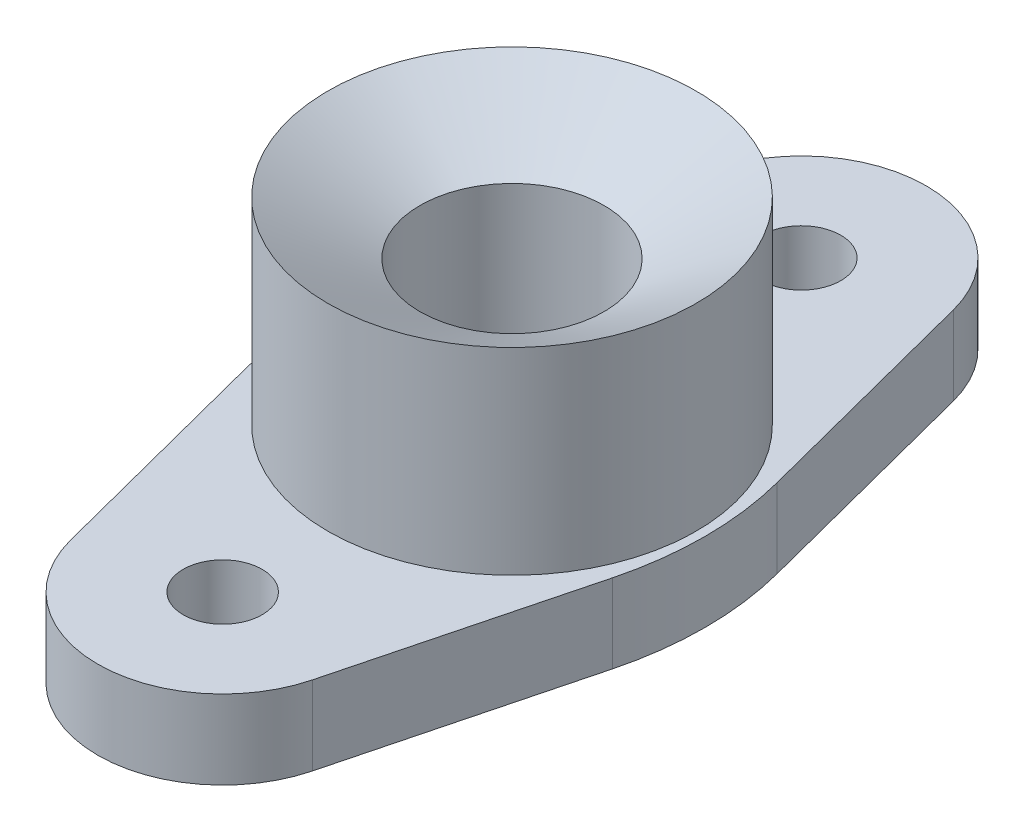
ISO-10303-21;
HEADER;
FILE_DESCRIPTION(('STEP AP214'),'2;1');
FILE_NAME('part.step','',(''),(''),'','','');
FILE_SCHEMA(('AUTOMOTIVE_DESIGN { 1 0 10303 214 1 1 1 1 }'));
ENDSEC;
DATA;
#1=APPLICATION_CONTEXT('core data for automotive mechanical design processes');
#2=APPLICATION_PROTOCOL_DEFINITION('international standard','automotive_design',2000,#1);
#3=PRODUCT_CONTEXT('',#1,'mechanical');
#4=PRODUCT('Part','Part','',(#3));
#5=PRODUCT_RELATED_PRODUCT_CATEGORY('part','',(#4));
#6=PRODUCT_DEFINITION_FORMATION('','',#4);
#7=PRODUCT_DEFINITION_CONTEXT('part definition',#1,'design');
#8=PRODUCT_DEFINITION('design','',#6,#7);
#9=PRODUCT_DEFINITION_SHAPE('','',#8);
#10=(LENGTH_UNIT() NAMED_UNIT(*) SI_UNIT(.MILLI.,.METRE.));
#11=(NAMED_UNIT(*) PLANE_ANGLE_UNIT() SI_UNIT($,.RADIAN.));
#12=(NAMED_UNIT(*) SI_UNIT($,.STERADIAN.) SOLID_ANGLE_UNIT());
#13=UNCERTAINTY_MEASURE_WITH_UNIT(LENGTH_MEASURE(1.E-05),#10,'distance_accuracy_value','');
#14=(GEOMETRIC_REPRESENTATION_CONTEXT(3) GLOBAL_UNCERTAINTY_ASSIGNED_CONTEXT((#13)) GLOBAL_UNIT_ASSIGNED_CONTEXT((#10,
#11,#12)) REPRESENTATION_CONTEXT('',''));
#15=CARTESIAN_POINT('',(0.,0.,0.));
#16=DIRECTION('',(0.,0.,1.));
#17=DIRECTION('',(1.,0.,0.));
#18=AXIS2_PLACEMENT_3D('',#15,#16,#17);
#19=CARTESIAN_POINT('',(0.,6.,44.));
#20=DIRECTION('',(0.,-1.,0.));
#21=DIRECTION('',(0.,0.,-1.));
#22=AXIS2_PLACEMENT_3D('',#19,#20,#21);
#23=CYLINDRICAL_SURFACE('',#22,19.);
#24=CARTESIAN_POINT('',(0.,-6.,44.));
#25=DIRECTION('',(0.,1.,0.));
#26=DIRECTION('',(0.,0.,1.));
#27=AXIS2_PLACEMENT_3D('',#24,#25,#26);
#28=CIRCLE('',#27,19.);
#29=CARTESIAN_POINT('',(-18.3951965051347,-6.,48.7557066286177));
#30=VERTEX_POINT('',#29);
#31=CARTESIAN_POINT('',(18.3951965051347,-6.,48.7557066286177));
#32=VERTEX_POINT('',#31);
#33=EDGE_CURVE('E132',#30,#32,#28,.T.);
#34=ORIENTED_EDGE('',*,*,#33,.T.);
#35=DIRECTION('',(0.,-1.,0.));
#36=VECTOR('',#35,1.);
#37=CARTESIAN_POINT('',(18.3951965051347,6.,48.7557066286177));
#38=LINE('',#37,#36);
#39=CARTESIAN_POINT('',(18.3951965051347,6.,48.7557066286177));
#40=VERTEX_POINT('',#39);
#41=EDGE_CURVE('E115',#40,#32,#38,.T.);
#42=ORIENTED_EDGE('',*,*,#41,.F.);
#43=CARTESIAN_POINT('',(0.,6.,44.));
#44=DIRECTION('',(0.,1.,0.));
#45=DIRECTION('',(0.,0.,1.));
#46=AXIS2_PLACEMENT_3D('',#43,#44,#45);
#47=CIRCLE('',#46,19.);
#48=CARTESIAN_POINT('',(-18.3951965051347,6.,48.7557066286177));
#49=VERTEX_POINT('',#48);
#50=EDGE_CURVE('E118',#49,#40,#47,.T.);
#51=ORIENTED_EDGE('',*,*,#50,.F.);
#52=DIRECTION('',(0.,-1.,0.));
#53=VECTOR('',#52,1.);
#54=CARTESIAN_POINT('',(-18.3951965051347,6.,48.7557066286177));
#55=LINE('',#54,#53);
#56=EDGE_CURVE('E181',#49,#30,#55,.T.);
#57=ORIENTED_EDGE('',*,*,#56,.T.);
#58=EDGE_LOOP('',(#34,#42,#51,#57));
#59=FACE_BOUND('',#58,.T.);
#60=ADVANCED_FACE('F45',(#59),#23,.T.);
#61=CARTESIAN_POINT('',(29.0578417959506,6.,7.51231827307484));
#62=DIRECTION('',(-0.968168237112355,0.,-0.250300348874615));
#63=DIRECTION('',(-0.250300348874615,0.,0.968168237112356));
#64=AXIS2_PLACEMENT_3D('',#61,#62,#63);
#65=PLANE('',#64);
#66=DIRECTION('',(0.250300348874615,0.,-0.968168237112356));
#67=VECTOR('',#66,1.);
#68=CARTESIAN_POINT('',(29.0578417959506,-6.,7.51231827307484));
#69=LINE('',#68,#67);
#70=CARTESIAN_POINT('',(27.7644949376973,-6.,12.5150174437308));
#71=VERTEX_POINT('',#70);
#72=EDGE_CURVE('E167',#32,#71,#69,.T.);
#73=ORIENTED_EDGE('',*,*,#72,.T.);
#74=DIRECTION('',(0.,-1.,0.));
#75=VECTOR('',#74,1.);
#76=CARTESIAN_POINT('',(27.7644949376973,6.,12.5150174437308));
#77=LINE('',#76,#75);
#78=CARTESIAN_POINT('',(27.7644949376973,6.,12.5150174437308));
#79=VERTEX_POINT('',#78);
#80=EDGE_CURVE('E54',#71,#79,#77,.F.);
#81=ORIENTED_EDGE('',*,*,#80,.T.);
#82=DIRECTION('',(0.250300348874615,0.,-0.968168237112356));
#83=VECTOR('',#82,1.);
#84=CARTESIAN_POINT('',(29.0578417959506,6.,7.51231827307484));
#85=LINE('',#84,#83);
#86=EDGE_CURVE('E111',#40,#79,#85,.T.);
#87=ORIENTED_EDGE('',*,*,#86,.F.);
#88=ORIENTED_EDGE('',*,*,#41,.T.);
#89=EDGE_LOOP('',(#73,#81,#87,#88));
#90=FACE_BOUND('',#89,.T.);
#91=ADVANCED_FACE('F113',(#90),#65,.F.);
#92=CARTESIAN_POINT('',(29.0578417959506,6.,-7.51231827307486));
#93=DIRECTION('',(0.968168237112355,0.,-0.250300348874615));
#94=DIRECTION('',(-0.250300348874615,0.,-0.968168237112355));
#95=AXIS2_PLACEMENT_3D('',#92,#93,#94);
#96=PLANE('',#95);
#97=DIRECTION('',(0.250300348874615,0.,0.968168237112355));
#98=VECTOR('',#97,1.);
#99=CARTESIAN_POINT('',(29.0578417959506,6.,-7.51231827307486));
#100=LINE('',#99,#98);
#101=CARTESIAN_POINT('',(18.3951965051347,6.,-48.7557066286177));
#102=VERTEX_POINT('',#101);
#103=CARTESIAN_POINT('',(27.7644949376973,6.,-12.5150174437307));
#104=VERTEX_POINT('',#103);
#105=EDGE_CURVE('E117',#102,#104,#100,.T.);
#106=ORIENTED_EDGE('',*,*,#105,.T.);
#107=DIRECTION('',(0.,-1.,0.));
#108=VECTOR('',#107,1.);
#109=CARTESIAN_POINT('',(27.7644949376973,-6.,-12.5150174437307));
#110=LINE('',#109,#108);
#111=CARTESIAN_POINT('',(27.7644949376973,-6.,-12.5150174437307));
#112=VERTEX_POINT('',#111);
#113=EDGE_CURVE('E151',#104,#112,#110,.T.);
#114=ORIENTED_EDGE('',*,*,#113,.T.);
#115=DIRECTION('',(0.250300348874615,0.,0.968168237112355));
#116=VECTOR('',#115,1.);
#117=CARTESIAN_POINT('',(29.0578417959506,-6.,-7.51231827307486));
#118=LINE('',#117,#116);
#119=CARTESIAN_POINT('',(18.3951965051347,-6.,-48.7557066286177));
#120=VERTEX_POINT('',#119);
#121=EDGE_CURVE('E158',#120,#112,#118,.T.);
#122=ORIENTED_EDGE('',*,*,#121,.F.);
#123=DIRECTION('',(0.,-1.,0.));
#124=VECTOR('',#123,1.);
#125=CARTESIAN_POINT('',(18.3951965051347,6.,-48.7557066286177));
#126=LINE('',#125,#124);
#127=EDGE_CURVE('E134',#102,#120,#126,.T.);
#128=ORIENTED_EDGE('',*,*,#127,.F.);
#129=EDGE_LOOP('',(#106,#114,#122,#128));
#130=FACE_BOUND('',#129,.T.);
#131=ADVANCED_FACE('F157',(#130),#96,.T.);
#132=CARTESIAN_POINT('',(0.,6.,-44.));
#133=DIRECTION('',(0.,-1.,0.));
#134=DIRECTION('',(0.,0.,-1.));
#135=AXIS2_PLACEMENT_3D('',#132,#133,#134);
#136=CYLINDRICAL_SURFACE('',#135,19.);
#137=CARTESIAN_POINT('',(0.,-6.,-44.));
#138=DIRECTION('',(0.,1.,0.));
#139=DIRECTION('',(0.,0.,1.));
#140=AXIS2_PLACEMENT_3D('',#137,#138,#139);
#141=CIRCLE('',#140,19.);
#142=CARTESIAN_POINT('',(-18.3951965051348,-6.,-48.7557066286177));
#143=VERTEX_POINT('',#142);
#144=EDGE_CURVE('E166',#120,#143,#141,.T.);
#145=ORIENTED_EDGE('',*,*,#144,.T.);
#146=DIRECTION('',(0.,-1.,0.));
#147=VECTOR('',#146,1.);
#148=CARTESIAN_POINT('',(-18.3951965051348,6.,-48.7557066286177));
#149=LINE('',#148,#147);
#150=CARTESIAN_POINT('',(-18.3951965051348,6.,-48.7557066286177));
#151=VERTEX_POINT('',#150);
#152=EDGE_CURVE('E139',#151,#143,#149,.T.);
#153=ORIENTED_EDGE('',*,*,#152,.F.);
#154=CARTESIAN_POINT('',(0.,6.,-44.));
#155=DIRECTION('',(0.,1.,0.));
#156=DIRECTION('',(0.,0.,1.));
#157=AXIS2_PLACEMENT_3D('',#154,#155,#156);
#158=CIRCLE('',#157,19.);
#159=EDGE_CURVE('E201',#102,#151,#158,.T.);
#160=ORIENTED_EDGE('',*,*,#159,.F.);
#161=ORIENTED_EDGE('',*,*,#127,.T.);
#162=EDGE_LOOP('',(#145,#153,#160,#161));
#163=FACE_BOUND('',#162,.T.);
#164=ADVANCED_FACE('F220',(#163),#136,.T.);
#165=CARTESIAN_POINT('',(-29.0578417959506,6.,-7.51231827307481));
#166=DIRECTION('',(0.968168237112356,0.,0.250300348874614));
#167=DIRECTION('',(0.250300348874614,0.,-0.968168237112356));
#168=AXIS2_PLACEMENT_3D('',#165,#166,#167);
#169=PLANE('',#168);
#170=DIRECTION('',(-0.250300348874614,0.,0.968168237112356));
#171=VECTOR('',#170,1.);
#172=CARTESIAN_POINT('',(-29.0578417959506,-6.,-7.51231827307481));
#173=LINE('',#172,#171);
#174=CARTESIAN_POINT('',(-27.7644949376973,-6.,-12.5150174437307));
#175=VERTEX_POINT('',#174);
#176=EDGE_CURVE('E169',#143,#175,#173,.T.);
#177=ORIENTED_EDGE('',*,*,#176,.T.);
#178=DIRECTION('',(0.,-1.,0.));
#179=VECTOR('',#178,1.);
#180=CARTESIAN_POINT('',(-27.7644949376973,6.,-12.5150174437307));
#181=LINE('',#180,#179);
#182=CARTESIAN_POINT('',(-27.7644949376973,6.,-12.5150174437307));
#183=VERTEX_POINT('',#182);
#184=EDGE_CURVE('E146',#175,#183,#181,.F.);
#185=ORIENTED_EDGE('',*,*,#184,.T.);
#186=DIRECTION('',(-0.250300348874614,0.,0.968168237112356));
#187=VECTOR('',#186,1.);
#188=CARTESIAN_POINT('',(-29.0578417959506,6.,-7.51231827307481));
#189=LINE('',#188,#187);
#190=EDGE_CURVE('E189',#151,#183,#189,.T.);
#191=ORIENTED_EDGE('',*,*,#190,.F.);
#192=ORIENTED_EDGE('',*,*,#152,.T.);
#193=EDGE_LOOP('',(#177,#185,#191,#192));
#194=FACE_BOUND('',#193,.T.);
#195=ADVANCED_FACE('F187',(#194),#169,.F.);
#196=CARTESIAN_POINT('',(-29.0578417959506,6.,7.51231827307483));
#197=DIRECTION('',(0.968168237112356,0.,-0.250300348874614));
#198=DIRECTION('',(-0.250300348874614,0.,-0.968168237112356));
#199=AXIS2_PLACEMENT_3D('',#196,#197,#198);
#200=PLANE('',#199);
#201=DIRECTION('',(0.250300348874614,0.,0.968168237112356));
#202=VECTOR('',#201,1.);
#203=CARTESIAN_POINT('',(-29.0578417959506,6.,7.51231827307483));
#204=LINE('',#203,#202);
#205=CARTESIAN_POINT('',(-27.7644949376973,6.,12.5150174437307));
#206=VERTEX_POINT('',#205);
#207=EDGE_CURVE('E125',#206,#49,#204,.T.);
#208=ORIENTED_EDGE('',*,*,#207,.F.);
#209=DIRECTION('',(0.,-1.,0.));
#210=VECTOR('',#209,1.);
#211=CARTESIAN_POINT('',(-27.7644949376973,6.,12.5150174437307));
#212=LINE('',#211,#210);
#213=CARTESIAN_POINT('',(-27.7644949376973,-6.,12.5150174437307));
#214=VERTEX_POINT('',#213);
#215=EDGE_CURVE('E133',#206,#214,#212,.T.);
#216=ORIENTED_EDGE('',*,*,#215,.T.);
#217=DIRECTION('',(0.250300348874614,0.,0.968168237112356));
#218=VECTOR('',#217,1.);
#219=CARTESIAN_POINT('',(-29.0578417959506,-6.,7.51231827307483));
#220=LINE('',#219,#218);
#221=EDGE_CURVE('E176',#214,#30,#220,.T.);
#222=ORIENTED_EDGE('',*,*,#221,.T.);
#223=ORIENTED_EDGE('',*,*,#56,.F.);
#224=EDGE_LOOP('',(#208,#216,#222,#223));
#225=FACE_BOUND('',#224,.T.);
#226=ADVANCED_FACE('F197',(#225),#200,.F.);
#227=CARTESIAN_POINT('',(0.,6.,44.));
#228=DIRECTION('',(0.,-1.,0.));
#229=DIRECTION('',(0.,0.,-1.));
#230=AXIS2_PLACEMENT_3D('',#227,#228,#229);
#231=CYLINDRICAL_SURFACE('',#230,6.);
#232=CARTESIAN_POINT('',(0.,6.,44.));
#233=DIRECTION('',(0.,1.,0.));
#234=DIRECTION('',(0.,0.,1.));
#235=AXIS2_PLACEMENT_3D('',#232,#233,#234);
#236=CIRCLE('',#235,6.);
#237=CARTESIAN_POINT('',(0.,6.,50.));
#238=VERTEX_POINT('',#237);
#239=EDGE_CURVE('E129',#238,#238,#236,.T.);
#240=ORIENTED_EDGE('',*,*,#239,.T.);
#241=EDGE_LOOP('',(#240));
#242=FACE_BOUND('',#241,.T.);
#243=CARTESIAN_POINT('',(0.,-6.,44.));
#244=DIRECTION('',(0.,1.,0.));
#245=DIRECTION('',(0.,0.,1.));
#246=AXIS2_PLACEMENT_3D('',#243,#244,#245);
#247=CIRCLE('',#246,6.);
#248=CARTESIAN_POINT('',(0.,-6.,50.));
#249=VERTEX_POINT('',#248);
#250=EDGE_CURVE('E205',#249,#249,#247,.T.);
#251=ORIENTED_EDGE('',*,*,#250,.F.);
#252=EDGE_LOOP('',(#251));
#253=FACE_BOUND('',#252,.T.);
#254=ADVANCED_FACE('F236',(#242,#253),#231,.F.);
#255=CARTESIAN_POINT('',(0.,6.,-44.));
#256=DIRECTION('',(0.,-1.,0.));
#257=DIRECTION('',(0.,0.,-1.));
#258=AXIS2_PLACEMENT_3D('',#255,#256,#257);
#259=CYLINDRICAL_SURFACE('',#258,6.);
#260=CARTESIAN_POINT('',(0.,6.,-44.));
#261=DIRECTION('',(0.,1.,0.));
#262=DIRECTION('',(0.,0.,1.));
#263=AXIS2_PLACEMENT_3D('',#260,#261,#262);
#264=CIRCLE('',#263,6.);
#265=CARTESIAN_POINT('',(0.,6.,-38.));
#266=VERTEX_POINT('',#265);
#267=EDGE_CURVE('E182',#266,#266,#264,.T.);
#268=ORIENTED_EDGE('',*,*,#267,.T.);
#269=EDGE_LOOP('',(#268));
#270=FACE_BOUND('',#269,.T.);
#271=CARTESIAN_POINT('',(0.,-6.,-44.));
#272=DIRECTION('',(0.,1.,0.));
#273=DIRECTION('',(0.,0.,1.));
#274=AXIS2_PLACEMENT_3D('',#271,#272,#273);
#275=CIRCLE('',#274,6.);
#276=CARTESIAN_POINT('',(0.,-6.,-38.));
#277=VERTEX_POINT('',#276);
#278=EDGE_CURVE('E178',#277,#277,#275,.T.);
#279=ORIENTED_EDGE('',*,*,#278,.F.);
#280=EDGE_LOOP('',(#279));
#281=FACE_BOUND('',#280,.T.);
#282=ADVANCED_FACE('F238',(#270,#281),#259,.F.);
#283=CARTESIAN_POINT('',(0.,6.,0.));
#284=DIRECTION('',(0.,1.,0.));
#285=DIRECTION('',(0.,0.,1.));
#286=AXIS2_PLACEMENT_3D('',#283,#284,#285);
#287=PLANE('',#286);
#288=CARTESIAN_POINT('',(0.,6.,0.));
#289=DIRECTION('',(0.,1.,0.));
#290=DIRECTION('',(0.,0.,1.));
#291=AXIS2_PLACEMENT_3D('',#288,#289,#290);
#292=CIRCLE('',#291,28.);
#293=CARTESIAN_POINT('',(0.,6.,28.));
#294=VERTEX_POINT('',#293);
#295=EDGE_CURVE('E11',#294,#294,#292,.T.);
#296=ORIENTED_EDGE('',*,*,#295,.F.);
#297=EDGE_LOOP('',(#296));
#298=FACE_BOUND('',#297,.T.);
#299=ORIENTED_EDGE('',*,*,#239,.F.);
#300=EDGE_LOOP('',(#299));
#301=FACE_BOUND('',#300,.T.);
#302=ORIENTED_EDGE('',*,*,#190,.T.);
#303=CARTESIAN_POINT('',(20.6439169179205,6.,0.));
#304=DIRECTION('',(0.,1.,0.));
#305=DIRECTION('',(0.,0.,1.));
#306=AXIS2_PLACEMENT_3D('',#303,#304,#305);
#307=CIRCLE('',#306,50.);
#308=EDGE_CURVE('E149',#183,#206,#307,.T.);
#309=ORIENTED_EDGE('',*,*,#308,.T.);
#310=ORIENTED_EDGE('',*,*,#207,.T.);
#311=ORIENTED_EDGE('',*,*,#50,.T.);
#312=ORIENTED_EDGE('',*,*,#86,.T.);
#313=CARTESIAN_POINT('',(-20.6439169179205,6.,0.));
#314=DIRECTION('',(0.,1.,0.));
#315=DIRECTION('',(0.,0.,1.));
#316=AXIS2_PLACEMENT_3D('',#313,#314,#315);
#317=CIRCLE('',#316,50.);
#318=EDGE_CURVE('E62',#79,#104,#317,.T.);
#319=ORIENTED_EDGE('',*,*,#318,.T.);
#320=ORIENTED_EDGE('',*,*,#105,.F.);
#321=ORIENTED_EDGE('',*,*,#159,.T.);
#322=EDGE_LOOP('',(#302,#309,#310,#311,#312,#319,#320,#321));
#323=FACE_BOUND('',#322,.T.);
#324=ORIENTED_EDGE('',*,*,#267,.F.);
#325=EDGE_LOOP('',(#324));
#326=FACE_BOUND('',#325,.T.);
#327=ADVANCED_FACE('F122',(#298,#301,#323,#326),#287,.T.);
#328=CARTESIAN_POINT('',(0.,-6.,0.));
#329=DIRECTION('',(0.,1.,0.));
#330=DIRECTION('',(0.,0.,1.));
#331=AXIS2_PLACEMENT_3D('',#328,#329,#330);
#332=PLANE('',#331);
#333=CARTESIAN_POINT('',(0.,-6.,0.));
#334=DIRECTION('',(0.,1.,0.));
#335=DIRECTION('',(0.,0.,1.));
#336=AXIS2_PLACEMENT_3D('',#333,#334,#335);
#337=CIRCLE('',#336,14.);
#338=CARTESIAN_POINT('',(0.,-6.,14.));
#339=VERTEX_POINT('',#338);
#340=EDGE_CURVE('E207',#339,#339,#337,.T.);
#341=ORIENTED_EDGE('',*,*,#340,.T.);
#342=EDGE_LOOP('',(#341));
#343=FACE_BOUND('',#342,.T.);
#344=ORIENTED_EDGE('',*,*,#250,.T.);
#345=EDGE_LOOP('',(#344));
#346=FACE_BOUND('',#345,.T.);
#347=ORIENTED_EDGE('',*,*,#221,.F.);
#348=CARTESIAN_POINT('',(20.6439169179205,-6.,0.));
#349=DIRECTION('',(0.,1.,0.));
#350=DIRECTION('',(0.,0.,1.));
#351=AXIS2_PLACEMENT_3D('',#348,#349,#350);
#352=CIRCLE('',#351,50.);
#353=EDGE_CURVE('E144',#214,#175,#352,.F.);
#354=ORIENTED_EDGE('',*,*,#353,.T.);
#355=ORIENTED_EDGE('',*,*,#176,.F.);
#356=ORIENTED_EDGE('',*,*,#144,.F.);
#357=ORIENTED_EDGE('',*,*,#121,.T.);
#358=CARTESIAN_POINT('',(-20.6439169179205,-6.,0.));
#359=DIRECTION('',(0.,1.,0.));
#360=DIRECTION('',(0.,0.,1.));
#361=AXIS2_PLACEMENT_3D('',#358,#359,#360);
#362=CIRCLE('',#361,50.);
#363=EDGE_CURVE('E137',#112,#71,#362,.F.);
#364=ORIENTED_EDGE('',*,*,#363,.T.);
#365=ORIENTED_EDGE('',*,*,#72,.F.);
#366=ORIENTED_EDGE('',*,*,#33,.F.);
#367=EDGE_LOOP('',(#347,#354,#355,#356,#357,#364,#365,#366));
#368=FACE_BOUND('',#367,.T.);
#369=ORIENTED_EDGE('',*,*,#278,.T.);
#370=EDGE_LOOP('',(#369));
#371=FACE_BOUND('',#370,.T.);
#372=ADVANCED_FACE('F163',(#343,#346,#368,#371),#332,.F.);
#373=CARTESIAN_POINT('',(20.6439169179205,6.,0.));
#374=DIRECTION('',(0.,-1.,0.));
#375=DIRECTION('',(0.,0.,-1.));
#376=AXIS2_PLACEMENT_3D('',#373,#374,#375);
#377=CYLINDRICAL_SURFACE('',#376,50.);
#378=ORIENTED_EDGE('',*,*,#308,.F.);
#379=ORIENTED_EDGE('',*,*,#184,.F.);
#380=ORIENTED_EDGE('',*,*,#353,.F.);
#381=ORIENTED_EDGE('',*,*,#215,.F.);
#382=EDGE_LOOP('',(#378,#379,#380,#381));
#383=FACE_BOUND('',#382,.T.);
#384=ADVANCED_FACE('F195',(#383),#377,.T.);
#385=CARTESIAN_POINT('',(-20.6439169179205,6.,0.));
#386=DIRECTION('',(0.,1.,0.));
#387=DIRECTION('',(0.,0.,1.));
#388=AXIS2_PLACEMENT_3D('',#385,#386,#387);
#389=CYLINDRICAL_SURFACE('',#388,50.);
#390=ORIENTED_EDGE('',*,*,#318,.F.);
#391=ORIENTED_EDGE('',*,*,#80,.F.);
#392=ORIENTED_EDGE('',*,*,#363,.F.);
#393=ORIENTED_EDGE('',*,*,#113,.F.);
#394=EDGE_LOOP('',(#390,#391,#392,#393));
#395=FACE_BOUND('',#394,.T.);
#396=ADVANCED_FACE('F47',(#395),#389,.T.);
#397=CARTESIAN_POINT('',(0.,36.,0.));
#398=DIRECTION('',(0.,-1.,0.));
#399=DIRECTION('',(0.,0.,-1.));
#400=AXIS2_PLACEMENT_3D('',#397,#398,#399);
#401=CYLINDRICAL_SURFACE('',#400,28.);
#402=CARTESIAN_POINT('',(0.,36.,0.));
#403=DIRECTION('',(0.,1.,0.));
#404=DIRECTION('',(0.,0.,1.));
#405=AXIS2_PLACEMENT_3D('',#402,#403,#404);
#406=CIRCLE('',#405,28.);
#407=CARTESIAN_POINT('',(0.,36.,28.));
#408=VERTEX_POINT('',#407);
#409=EDGE_CURVE('E215',#408,#408,#406,.T.);
#410=ORIENTED_EDGE('',*,*,#409,.F.);
#411=EDGE_LOOP('',(#410));
#412=FACE_BOUND('',#411,.T.);
#413=ORIENTED_EDGE('',*,*,#295,.T.);
#414=EDGE_LOOP('',(#413));
#415=FACE_BOUND('',#414,.T.);
#416=ADVANCED_FACE('F245',(#412,#415),#401,.T.);
#417=CARTESIAN_POINT('',(0.,36.,0.));
#418=DIRECTION('',(0.,-1.,0.));
#419=DIRECTION('',(0.,0.,-1.));
#420=AXIS2_PLACEMENT_3D('',#417,#418,#419);
#421=CYLINDRICAL_SURFACE('',#420,14.);
#422=CARTESIAN_POINT('',(0.,27.9170962313453,0.));
#423=DIRECTION('',(0.,1.,0.));
#424=DIRECTION('',(0.,0.,1.));
#425=AXIS2_PLACEMENT_3D('',#422,#423,#424);
#426=CIRCLE('',#425,14.);
#427=CARTESIAN_POINT('',(0.,27.9170962313453,14.));
#428=VERTEX_POINT('',#427);
#429=EDGE_CURVE('E49',#428,#428,#426,.F.);
#430=ORIENTED_EDGE('',*,*,#429,.F.);
#431=EDGE_LOOP('',(#430));
#432=FACE_BOUND('',#431,.T.);
#433=ORIENTED_EDGE('',*,*,#340,.F.);
#434=EDGE_LOOP('',(#433));
#435=FACE_BOUND('',#434,.T.);
#436=ADVANCED_FACE('F288',(#432,#435),#421,.F.);
#437=CARTESIAN_POINT('',(0.,36.,0.));
#438=DIRECTION('',(0.,1.,0.));
#439=DIRECTION('',(0.,0.,1.));
#440=AXIS2_PLACEMENT_3D('',#437,#438,#439);
#441=CONICAL_SURFACE('',#440,28.,1.0471975511966);
#442=ORIENTED_EDGE('',*,*,#429,.T.);
#443=EDGE_LOOP('',(#442));
#444=FACE_BOUND('',#443,.T.);
#445=ORIENTED_EDGE('',*,*,#409,.T.);
#446=EDGE_LOOP('',(#445));
#447=FACE_BOUND('',#446,.T.);
#448=ADVANCED_FACE('F305',(#444,#447),#441,.F.);
#449=CLOSED_SHELL('',(#60,#91,#131,#164,#195,#226,#254,#282,#327,#372,#384,#396,#416,#436,#448));
#450=MANIFOLD_SOLID_BREP('B2',#449);
#451=ADVANCED_BREP_SHAPE_REPRESENTATION('',(#18,#450),#14);
#452=SHAPE_DEFINITION_REPRESENTATION(#9,#451);
ENDSEC;
END-ISO-10303-21;
